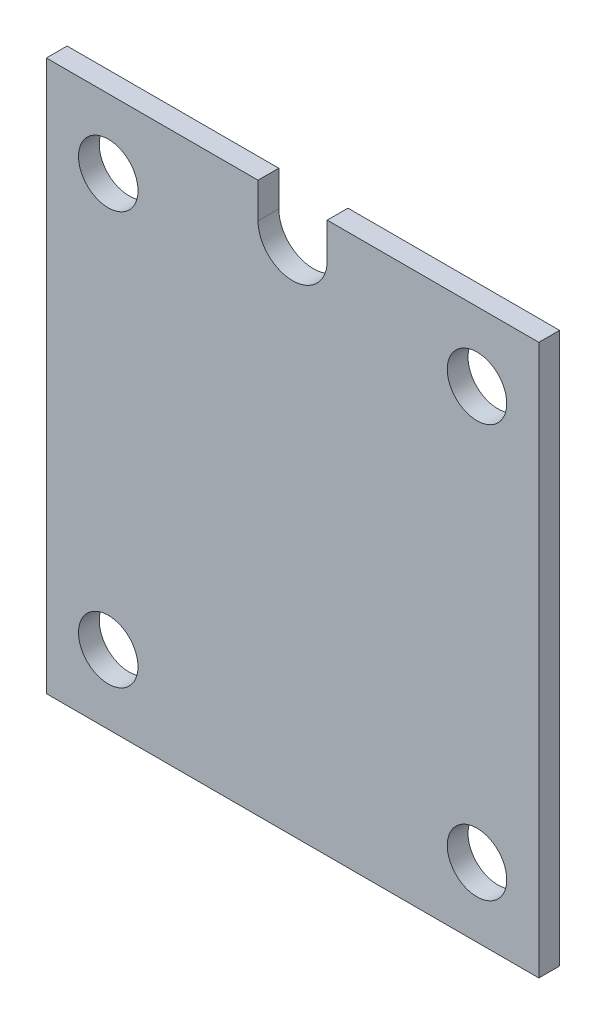
ISO-10303-21;
HEADER;
FILE_DESCRIPTION(('STEP AP214'),'2;1');
FILE_NAME('part.step','',(''),(''),'','','');
FILE_SCHEMA(('AUTOMOTIVE_DESIGN { 1 0 10303 214 1 1 1 1 }'));
ENDSEC;
DATA;
#1=APPLICATION_CONTEXT('core data for automotive mechanical design processes');
#2=APPLICATION_PROTOCOL_DEFINITION('international standard','automotive_design',2000,#1);
#3=PRODUCT_CONTEXT('',#1,'mechanical');
#4=PRODUCT('Part','Part','',(#3));
#5=PRODUCT_RELATED_PRODUCT_CATEGORY('part','',(#4));
#6=PRODUCT_DEFINITION_FORMATION('','',#4);
#7=PRODUCT_DEFINITION_CONTEXT('part definition',#1,'design');
#8=PRODUCT_DEFINITION('design','',#6,#7);
#9=PRODUCT_DEFINITION_SHAPE('','',#8);
#10=(LENGTH_UNIT() NAMED_UNIT(*) SI_UNIT(.MILLI.,.METRE.));
#11=(NAMED_UNIT(*) PLANE_ANGLE_UNIT() SI_UNIT($,.RADIAN.));
#12=(NAMED_UNIT(*) SI_UNIT($,.STERADIAN.) SOLID_ANGLE_UNIT());
#13=UNCERTAINTY_MEASURE_WITH_UNIT(LENGTH_MEASURE(1.E-05),#10,'distance_accuracy_value','');
#14=(GEOMETRIC_REPRESENTATION_CONTEXT(3) GLOBAL_UNCERTAINTY_ASSIGNED_CONTEXT((#13)) GLOBAL_UNIT_ASSIGNED_CONTEXT((#10,
#11,#12)) REPRESENTATION_CONTEXT('',''));
#15=CARTESIAN_POINT('',(0.,0.,0.));
#16=DIRECTION('',(0.,0.,1.));
#17=DIRECTION('',(1.,0.,0.));
#18=AXIS2_PLACEMENT_3D('',#15,#16,#17);
#19=CARTESIAN_POINT('',(0.,34.7,3.));
#20=DIRECTION('',(0.,0.,-1.));
#21=DIRECTION('',(-1.,0.,0.));
#22=AXIS2_PLACEMENT_3D('',#19,#20,#21);
#23=CYLINDRICAL_SURFACE('',#22,5.);
#24=CARTESIAN_POINT('',(0.,34.7,0.));
#25=DIRECTION('',(0.,0.,1.));
#26=DIRECTION('',(1.,0.,0.));
#27=AXIS2_PLACEMENT_3D('',#24,#25,#26);
#28=CIRCLE('',#27,5.);
#29=CARTESIAN_POINT('',(-5.,34.7,0.));
#30=VERTEX_POINT('',#29);
#31=CARTESIAN_POINT('',(5.,34.7,0.));
#32=VERTEX_POINT('',#31);
#33=EDGE_CURVE('E171',#30,#32,#28,.T.);
#34=ORIENTED_EDGE('',*,*,#33,.F.);
#35=DIRECTION('',(0.,0.,-1.));
#36=VECTOR('',#35,1.);
#37=CARTESIAN_POINT('',(-5.,34.7,3.));
#38=LINE('',#37,#36);
#39=CARTESIAN_POINT('',(-5.,34.7,3.));
#40=VERTEX_POINT('',#39);
#41=EDGE_CURVE('E11',#40,#30,#38,.T.);
#42=ORIENTED_EDGE('',*,*,#41,.F.);
#43=CARTESIAN_POINT('',(0.,34.7,3.));
#44=DIRECTION('',(0.,0.,1.));
#45=DIRECTION('',(1.,0.,0.));
#46=AXIS2_PLACEMENT_3D('',#43,#44,#45);
#47=CIRCLE('',#46,5.);
#48=CARTESIAN_POINT('',(5.,34.7,3.));
#49=VERTEX_POINT('',#48);
#50=EDGE_CURVE('E139',#40,#49,#47,.T.);
#51=ORIENTED_EDGE('',*,*,#50,.T.);
#52=DIRECTION('',(0.,0.,-1.));
#53=VECTOR('',#52,1.);
#54=CARTESIAN_POINT('',(5.,34.7,3.));
#55=LINE('',#54,#53);
#56=EDGE_CURVE('E51',#49,#32,#55,.T.);
#57=ORIENTED_EDGE('',*,*,#56,.T.);
#58=EDGE_LOOP('',(#34,#42,#51,#57));
#59=FACE_BOUND('',#58,.T.);
#60=ADVANCED_FACE('F35',(#59),#23,.F.);
#61=CARTESIAN_POINT('',(-5.,0.,3.));
#62=DIRECTION('',(-1.,0.,0.));
#63=DIRECTION('',(0.,0.,1.));
#64=AXIS2_PLACEMENT_3D('',#61,#62,#63);
#65=PLANE('',#64);
#66=DIRECTION('',(0.,1.,0.));
#67=VECTOR('',#66,1.);
#68=CARTESIAN_POINT('',(-5.,0.,0.));
#69=LINE('',#68,#67);
#70=CARTESIAN_POINT('',(-5.,39.7849441991025,0.));
#71=VERTEX_POINT('',#70);
#72=EDGE_CURVE('E168',#30,#71,#69,.T.);
#73=ORIENTED_EDGE('',*,*,#72,.T.);
#74=DIRECTION('',(0.,0.,-1.));
#75=VECTOR('',#74,1.);
#76=CARTESIAN_POINT('',(-5.,39.7849441991025,3.));
#77=LINE('',#76,#75);
#78=CARTESIAN_POINT('',(-5.,39.7849441991025,3.));
#79=VERTEX_POINT('',#78);
#80=EDGE_CURVE('E43',#79,#71,#77,.T.);
#81=ORIENTED_EDGE('',*,*,#80,.F.);
#82=DIRECTION('',(0.,1.,0.));
#83=VECTOR('',#82,1.);
#84=CARTESIAN_POINT('',(-5.,0.,3.));
#85=LINE('',#84,#83);
#86=EDGE_CURVE('E135',#40,#79,#85,.T.);
#87=ORIENTED_EDGE('',*,*,#86,.F.);
#88=ORIENTED_EDGE('',*,*,#41,.T.);
#89=EDGE_LOOP('',(#73,#81,#87,#88));
#90=FACE_BOUND('',#89,.T.);
#91=ADVANCED_FACE('F169',(#90),#65,.F.);
#92=CARTESIAN_POINT('',(0.,39.7849441991025,3.));
#93=DIRECTION('',(0.,1.,0.));
#94=DIRECTION('',(0.,0.,1.));
#95=AXIS2_PLACEMENT_3D('',#92,#93,#94);
#96=PLANE('',#95);
#97=DIRECTION('',(1.,0.,0.));
#98=VECTOR('',#97,1.);
#99=CARTESIAN_POINT('',(0.,39.7849441991025,0.));
#100=LINE('',#99,#98);
#101=CARTESIAN_POINT('',(-35.5927941804843,39.7849441991025,0.));
#102=VERTEX_POINT('',#101);
#103=EDGE_CURVE('E164',#102,#71,#100,.T.);
#104=ORIENTED_EDGE('',*,*,#103,.F.);
#105=DIRECTION('',(0.,0.,-1.));
#106=VECTOR('',#105,1.);
#107=CARTESIAN_POINT('',(-35.5927941804843,39.7849441991025,3.));
#108=LINE('',#107,#106);
#109=CARTESIAN_POINT('',(-35.5927941804843,39.7849441991025,3.));
#110=VERTEX_POINT('',#109);
#111=EDGE_CURVE('E159',#110,#102,#108,.T.);
#112=ORIENTED_EDGE('',*,*,#111,.F.);
#113=DIRECTION('',(1.,0.,0.));
#114=VECTOR('',#113,1.);
#115=CARTESIAN_POINT('',(0.,39.7849441991025,3.));
#116=LINE('',#115,#114);
#117=EDGE_CURVE('E128',#110,#79,#116,.T.);
#118=ORIENTED_EDGE('',*,*,#117,.T.);
#119=ORIENTED_EDGE('',*,*,#80,.T.);
#120=EDGE_LOOP('',(#104,#112,#118,#119));
#121=FACE_BOUND('',#120,.T.);
#122=ADVANCED_FACE('F162',(#121),#96,.T.);
#123=CARTESIAN_POINT('',(-35.5927941804843,0.,3.));
#124=DIRECTION('',(-1.,0.,0.));
#125=DIRECTION('',(0.,0.,1.));
#126=AXIS2_PLACEMENT_3D('',#123,#124,#125);
#127=PLANE('',#126);
#128=DIRECTION('',(0.,1.,0.));
#129=VECTOR('',#128,1.);
#130=CARTESIAN_POINT('',(-35.5927941804843,0.,0.));
#131=LINE('',#130,#129);
#132=CARTESIAN_POINT('',(-35.5927941804843,-39.7849441991025,0.));
#133=VERTEX_POINT('',#132);
#134=EDGE_CURVE('E177',#133,#102,#131,.T.);
#135=ORIENTED_EDGE('',*,*,#134,.F.);
#136=DIRECTION('',(0.,0.,-1.));
#137=VECTOR('',#136,1.);
#138=CARTESIAN_POINT('',(-35.5927941804843,-39.7849441991025,3.));
#139=LINE('',#138,#137);
#140=CARTESIAN_POINT('',(-35.5927941804843,-39.7849441991025,3.));
#141=VERTEX_POINT('',#140);
#142=EDGE_CURVE('E157',#141,#133,#139,.T.);
#143=ORIENTED_EDGE('',*,*,#142,.F.);
#144=DIRECTION('',(0.,1.,0.));
#145=VECTOR('',#144,1.);
#146=CARTESIAN_POINT('',(-35.5927941804843,0.,3.));
#147=LINE('',#146,#145);
#148=EDGE_CURVE('E134',#141,#110,#147,.T.);
#149=ORIENTED_EDGE('',*,*,#148,.T.);
#150=ORIENTED_EDGE('',*,*,#111,.T.);
#151=EDGE_LOOP('',(#135,#143,#149,#150));
#152=FACE_BOUND('',#151,.T.);
#153=ADVANCED_FACE('F307',(#152),#127,.T.);
#154=CARTESIAN_POINT('',(0.,-39.7849441991025,3.));
#155=DIRECTION('',(0.,1.,0.));
#156=DIRECTION('',(0.,0.,1.));
#157=AXIS2_PLACEMENT_3D('',#154,#155,#156);
#158=PLANE('',#157);
#159=DIRECTION('',(1.,0.,0.));
#160=VECTOR('',#159,1.);
#161=CARTESIAN_POINT('',(0.,-39.7849441991025,0.));
#162=LINE('',#161,#160);
#163=CARTESIAN_POINT('',(35.5927941804843,-39.7849441991025,0.));
#164=VERTEX_POINT('',#163);
#165=EDGE_CURVE('E180',#133,#164,#162,.T.);
#166=ORIENTED_EDGE('',*,*,#165,.T.);
#167=DIRECTION('',(0.,0.,-1.));
#168=VECTOR('',#167,1.);
#169=CARTESIAN_POINT('',(35.5927941804843,-39.7849441991025,3.));
#170=LINE('',#169,#168);
#171=CARTESIAN_POINT('',(35.5927941804843,-39.7849441991025,3.));
#172=VERTEX_POINT('',#171);
#173=EDGE_CURVE('E123',#172,#164,#170,.T.);
#174=ORIENTED_EDGE('',*,*,#173,.F.);
#175=DIRECTION('',(1.,0.,0.));
#176=VECTOR('',#175,1.);
#177=CARTESIAN_POINT('',(0.,-39.7849441991025,3.));
#178=LINE('',#177,#176);
#179=EDGE_CURVE('E111',#141,#172,#178,.T.);
#180=ORIENTED_EDGE('',*,*,#179,.F.);
#181=ORIENTED_EDGE('',*,*,#142,.T.);
#182=EDGE_LOOP('',(#166,#174,#180,#181));
#183=FACE_BOUND('',#182,.T.);
#184=ADVANCED_FACE('F298',(#183),#158,.F.);
#185=CARTESIAN_POINT('',(35.5927941804843,0.,3.));
#186=DIRECTION('',(-1.,0.,0.));
#187=DIRECTION('',(0.,0.,1.));
#188=AXIS2_PLACEMENT_3D('',#185,#186,#187);
#189=PLANE('',#188);
#190=DIRECTION('',(0.,1.,0.));
#191=VECTOR('',#190,1.);
#192=CARTESIAN_POINT('',(35.5927941804843,0.,0.));
#193=LINE('',#192,#191);
#194=CARTESIAN_POINT('',(35.5927941804843,39.7849441991025,0.));
#195=VERTEX_POINT('',#194);
#196=EDGE_CURVE('E120',#164,#195,#193,.T.);
#197=ORIENTED_EDGE('',*,*,#196,.T.);
#198=DIRECTION('',(0.,0.,-1.));
#199=VECTOR('',#198,1.);
#200=CARTESIAN_POINT('',(35.5927941804843,39.7849441991025,3.));
#201=LINE('',#200,#199);
#202=CARTESIAN_POINT('',(35.5927941804843,39.7849441991025,3.));
#203=VERTEX_POINT('',#202);
#204=EDGE_CURVE('E117',#203,#195,#201,.T.);
#205=ORIENTED_EDGE('',*,*,#204,.F.);
#206=DIRECTION('',(0.,1.,0.));
#207=VECTOR('',#206,1.);
#208=CARTESIAN_POINT('',(35.5927941804843,0.,3.));
#209=LINE('',#208,#207);
#210=EDGE_CURVE('E101',#172,#203,#209,.T.);
#211=ORIENTED_EDGE('',*,*,#210,.F.);
#212=ORIENTED_EDGE('',*,*,#173,.T.);
#213=EDGE_LOOP('',(#197,#205,#211,#212));
#214=FACE_BOUND('',#213,.T.);
#215=ADVANCED_FACE('F118',(#214),#189,.F.);
#216=CARTESIAN_POINT('',(5.,39.7849441991025,0.));
#217=VERTEX_POINT('',#216);
#218=EDGE_CURVE('E179',#217,#195,#100,.T.);
#219=ORIENTED_EDGE('',*,*,#218,.F.);
#220=DIRECTION('',(0.,0.,-1.));
#221=VECTOR('',#220,1.);
#222=CARTESIAN_POINT('',(5.,39.7849441991025,3.));
#223=LINE('',#222,#221);
#224=CARTESIAN_POINT('',(5.,39.7849441991025,3.));
#225=VERTEX_POINT('',#224);
#226=EDGE_CURVE('E76',#225,#217,#223,.T.);
#227=ORIENTED_EDGE('',*,*,#226,.F.);
#228=EDGE_CURVE('E108',#225,#203,#116,.T.);
#229=ORIENTED_EDGE('',*,*,#228,.T.);
#230=ORIENTED_EDGE('',*,*,#204,.T.);
#231=EDGE_LOOP('',(#219,#227,#229,#230));
#232=FACE_BOUND('',#231,.T.);
#233=ADVANCED_FACE('F125',(#232),#96,.T.);
#234=CARTESIAN_POINT('',(26.65,-29.8,3.));
#235=DIRECTION('',(0.,0.,-1.));
#236=DIRECTION('',(-1.,0.,0.));
#237=AXIS2_PLACEMENT_3D('',#234,#235,#236);
#238=CYLINDRICAL_SURFACE('',#237,4.3);
#239=CARTESIAN_POINT('',(26.65,-29.8,3.));
#240=DIRECTION('',(0.,0.,1.));
#241=DIRECTION('',(1.,0.,0.));
#242=AXIS2_PLACEMENT_3D('',#239,#240,#241);
#243=CIRCLE('',#242,4.3);
#244=CARTESIAN_POINT('',(30.95,-29.8,3.));
#245=VERTEX_POINT('',#244);
#246=EDGE_CURVE('E219',#245,#245,#243,.T.);
#247=ORIENTED_EDGE('',*,*,#246,.T.);
#248=EDGE_LOOP('',(#247));
#249=FACE_BOUND('',#248,.T.);
#250=CARTESIAN_POINT('',(26.65,-29.8,0.));
#251=DIRECTION('',(0.,0.,1.));
#252=DIRECTION('',(1.,0.,0.));
#253=AXIS2_PLACEMENT_3D('',#250,#251,#252);
#254=CIRCLE('',#253,4.3);
#255=CARTESIAN_POINT('',(30.95,-29.8,0.));
#256=VERTEX_POINT('',#255);
#257=EDGE_CURVE('E144',#256,#256,#254,.T.);
#258=ORIENTED_EDGE('',*,*,#257,.F.);
#259=EDGE_LOOP('',(#258));
#260=FACE_BOUND('',#259,.T.);
#261=ADVANCED_FACE('F198',(#249,#260),#238,.F.);
#262=CARTESIAN_POINT('',(-26.65,-29.8,3.));
#263=DIRECTION('',(0.,0.,-1.));
#264=DIRECTION('',(-1.,0.,0.));
#265=AXIS2_PLACEMENT_3D('',#262,#263,#264);
#266=CYLINDRICAL_SURFACE('',#265,4.3);
#267=CARTESIAN_POINT('',(-26.65,-29.8,3.));
#268=DIRECTION('',(0.,0.,1.));
#269=DIRECTION('',(1.,0.,0.));
#270=AXIS2_PLACEMENT_3D('',#267,#268,#269);
#271=CIRCLE('',#270,4.3);
#272=CARTESIAN_POINT('',(-22.35,-29.8,3.));
#273=VERTEX_POINT('',#272);
#274=EDGE_CURVE('E222',#273,#273,#271,.T.);
#275=ORIENTED_EDGE('',*,*,#274,.T.);
#276=EDGE_LOOP('',(#275));
#277=FACE_BOUND('',#276,.T.);
#278=CARTESIAN_POINT('',(-26.65,-29.8,0.));
#279=DIRECTION('',(0.,0.,1.));
#280=DIRECTION('',(1.,0.,0.));
#281=AXIS2_PLACEMENT_3D('',#278,#279,#280);
#282=CIRCLE('',#281,4.3);
#283=CARTESIAN_POINT('',(-22.35,-29.8,0.));
#284=VERTEX_POINT('',#283);
#285=EDGE_CURVE('E149',#284,#284,#282,.T.);
#286=ORIENTED_EDGE('',*,*,#285,.F.);
#287=EDGE_LOOP('',(#286));
#288=FACE_BOUND('',#287,.T.);
#289=ADVANCED_FACE('F195',(#277,#288),#266,.F.);
#290=CARTESIAN_POINT('',(-26.65,29.8,3.));
#291=DIRECTION('',(0.,0.,-1.));
#292=DIRECTION('',(-1.,0.,0.));
#293=AXIS2_PLACEMENT_3D('',#290,#291,#292);
#294=CYLINDRICAL_SURFACE('',#293,4.3);
#295=CARTESIAN_POINT('',(-26.65,29.8,3.));
#296=DIRECTION('',(0.,0.,1.));
#297=DIRECTION('',(1.,0.,0.));
#298=AXIS2_PLACEMENT_3D('',#295,#296,#297);
#299=CIRCLE('',#298,4.3);
#300=CARTESIAN_POINT('',(-22.35,29.8,3.));
#301=VERTEX_POINT('',#300);
#302=EDGE_CURVE('E129',#301,#301,#299,.T.);
#303=ORIENTED_EDGE('',*,*,#302,.T.);
#304=EDGE_LOOP('',(#303));
#305=FACE_BOUND('',#304,.T.);
#306=CARTESIAN_POINT('',(-26.65,29.8,0.));
#307=DIRECTION('',(0.,0.,1.));
#308=DIRECTION('',(1.,0.,0.));
#309=AXIS2_PLACEMENT_3D('',#306,#307,#308);
#310=CIRCLE('',#309,4.3);
#311=CARTESIAN_POINT('',(-22.35,29.8,0.));
#312=VERTEX_POINT('',#311);
#313=EDGE_CURVE('E184',#312,#312,#310,.T.);
#314=ORIENTED_EDGE('',*,*,#313,.F.);
#315=EDGE_LOOP('',(#314));
#316=FACE_BOUND('',#315,.T.);
#317=ADVANCED_FACE('F197',(#305,#316),#294,.F.);
#318=CARTESIAN_POINT('',(5.,0.,3.));
#319=DIRECTION('',(-1.,0.,0.));
#320=DIRECTION('',(0.,0.,1.));
#321=AXIS2_PLACEMENT_3D('',#318,#319,#320);
#322=PLANE('',#321);
#323=DIRECTION('',(0.,1.,0.));
#324=VECTOR('',#323,1.);
#325=CARTESIAN_POINT('',(5.,0.,0.));
#326=LINE('',#325,#324);
#327=EDGE_CURVE('E182',#32,#217,#326,.T.);
#328=ORIENTED_EDGE('',*,*,#327,.F.);
#329=ORIENTED_EDGE('',*,*,#56,.F.);
#330=DIRECTION('',(0.,1.,0.));
#331=VECTOR('',#330,1.);
#332=CARTESIAN_POINT('',(5.,0.,3.));
#333=LINE('',#332,#331);
#334=EDGE_CURVE('E126',#49,#225,#333,.T.);
#335=ORIENTED_EDGE('',*,*,#334,.T.);
#336=ORIENTED_EDGE('',*,*,#226,.T.);
#337=EDGE_LOOP('',(#328,#329,#335,#336));
#338=FACE_BOUND('',#337,.T.);
#339=ADVANCED_FACE('F205',(#338),#322,.T.);
#340=CARTESIAN_POINT('',(26.65,29.8,3.));
#341=DIRECTION('',(0.,0.,-1.));
#342=DIRECTION('',(-1.,0.,0.));
#343=AXIS2_PLACEMENT_3D('',#340,#341,#342);
#344=CYLINDRICAL_SURFACE('',#343,4.3);
#345=CARTESIAN_POINT('',(26.65,29.8,3.));
#346=DIRECTION('',(0.,0.,1.));
#347=DIRECTION('',(1.,0.,0.));
#348=AXIS2_PLACEMENT_3D('',#345,#346,#347);
#349=CIRCLE('',#348,4.3);
#350=CARTESIAN_POINT('',(30.95,29.8,3.));
#351=VERTEX_POINT('',#350);
#352=EDGE_CURVE('E154',#351,#351,#349,.T.);
#353=ORIENTED_EDGE('',*,*,#352,.T.);
#354=EDGE_LOOP('',(#353));
#355=FACE_BOUND('',#354,.T.);
#356=CARTESIAN_POINT('',(26.65,29.8,0.));
#357=DIRECTION('',(0.,0.,1.));
#358=DIRECTION('',(1.,0.,0.));
#359=AXIS2_PLACEMENT_3D('',#356,#357,#358);
#360=CIRCLE('',#359,4.3);
#361=CARTESIAN_POINT('',(30.95,29.8,0.));
#362=VERTEX_POINT('',#361);
#363=EDGE_CURVE('E141',#362,#362,#360,.T.);
#364=ORIENTED_EDGE('',*,*,#363,.F.);
#365=EDGE_LOOP('',(#364));
#366=FACE_BOUND('',#365,.T.);
#367=ADVANCED_FACE('F230',(#355,#366),#344,.F.);
#368=CARTESIAN_POINT('',(0.,0.,3.));
#369=DIRECTION('',(0.,0.,1.));
#370=DIRECTION('',(1.,0.,0.));
#371=AXIS2_PLACEMENT_3D('',#368,#369,#370);
#372=PLANE('',#371);
#373=ORIENTED_EDGE('',*,*,#50,.F.);
#374=ORIENTED_EDGE('',*,*,#86,.T.);
#375=ORIENTED_EDGE('',*,*,#117,.F.);
#376=ORIENTED_EDGE('',*,*,#148,.F.);
#377=ORIENTED_EDGE('',*,*,#179,.T.);
#378=ORIENTED_EDGE('',*,*,#210,.T.);
#379=ORIENTED_EDGE('',*,*,#228,.F.);
#380=ORIENTED_EDGE('',*,*,#334,.F.);
#381=EDGE_LOOP('',(#373,#374,#375,#376,#377,#378,#379,#380));
#382=FACE_BOUND('',#381,.T.);
#383=ORIENTED_EDGE('',*,*,#302,.F.);
#384=EDGE_LOOP('',(#383));
#385=FACE_BOUND('',#384,.T.);
#386=ORIENTED_EDGE('',*,*,#274,.F.);
#387=EDGE_LOOP('',(#386));
#388=FACE_BOUND('',#387,.T.);
#389=ORIENTED_EDGE('',*,*,#246,.F.);
#390=EDGE_LOOP('',(#389));
#391=FACE_BOUND('',#390,.T.);
#392=ORIENTED_EDGE('',*,*,#352,.F.);
#393=EDGE_LOOP('',(#392));
#394=FACE_BOUND('',#393,.T.);
#395=ADVANCED_FACE('F104',(#382,#385,#388,#391,#394),#372,.T.);
#396=CARTESIAN_POINT('',(0.,0.,0.));
#397=DIRECTION('',(0.,0.,1.));
#398=DIRECTION('',(1.,0.,0.));
#399=AXIS2_PLACEMENT_3D('',#396,#397,#398);
#400=PLANE('',#399);
#401=ORIENTED_EDGE('',*,*,#33,.T.);
#402=ORIENTED_EDGE('',*,*,#327,.T.);
#403=ORIENTED_EDGE('',*,*,#218,.T.);
#404=ORIENTED_EDGE('',*,*,#196,.F.);
#405=ORIENTED_EDGE('',*,*,#165,.F.);
#406=ORIENTED_EDGE('',*,*,#134,.T.);
#407=ORIENTED_EDGE('',*,*,#103,.T.);
#408=ORIENTED_EDGE('',*,*,#72,.F.);
#409=EDGE_LOOP('',(#401,#402,#403,#404,#405,#406,#407,#408));
#410=FACE_BOUND('',#409,.T.);
#411=ORIENTED_EDGE('',*,*,#313,.T.);
#412=EDGE_LOOP('',(#411));
#413=FACE_BOUND('',#412,.T.);
#414=ORIENTED_EDGE('',*,*,#285,.T.);
#415=EDGE_LOOP('',(#414));
#416=FACE_BOUND('',#415,.T.);
#417=ORIENTED_EDGE('',*,*,#257,.T.);
#418=EDGE_LOOP('',(#417));
#419=FACE_BOUND('',#418,.T.);
#420=ORIENTED_EDGE('',*,*,#363,.T.);
#421=EDGE_LOOP('',(#420));
#422=FACE_BOUND('',#421,.T.);
#423=ADVANCED_FACE('F173',(#410,#413,#416,#419,#422),#400,.F.);
#424=CLOSED_SHELL('',(#60,#91,#122,#153,#184,#215,#233,#261,#289,#317,#339,#367,#395,#423));
#425=MANIFOLD_SOLID_BREP('B2',#424);
#426=ADVANCED_BREP_SHAPE_REPRESENTATION('',(#18,#425),#14);
#427=SHAPE_DEFINITION_REPRESENTATION(#9,#426);
ENDSEC;
END-ISO-10303-21;
